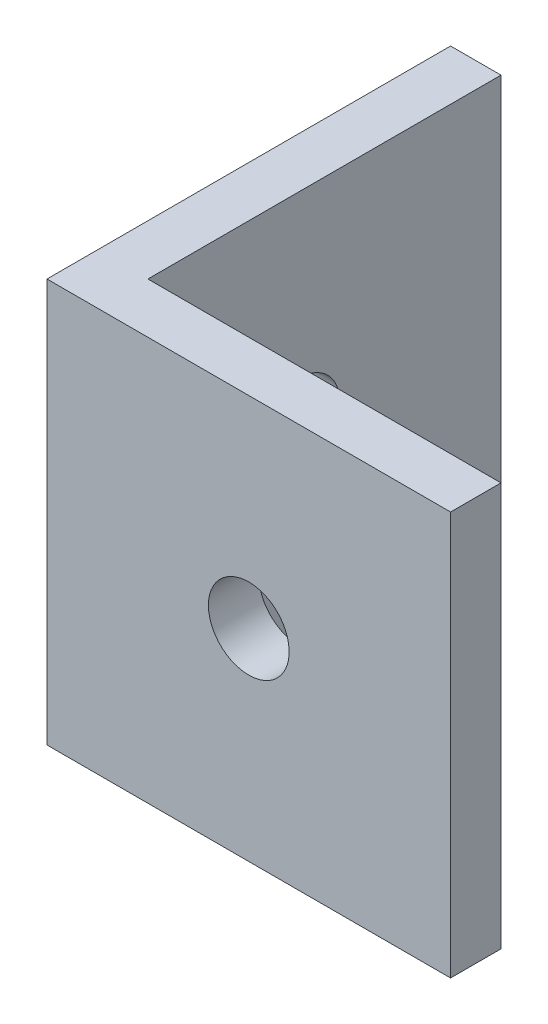
ISO-10303-21;
HEADER;
FILE_DESCRIPTION(('STEP AP214'),'2;1');
FILE_NAME('part.step','',(''),(''),'','','');
FILE_SCHEMA(('AUTOMOTIVE_DESIGN { 1 0 10303 214 1 1 1 1 }'));
ENDSEC;
DATA;
#1=APPLICATION_CONTEXT('core data for automotive mechanical design processes');
#2=APPLICATION_PROTOCOL_DEFINITION('international standard','automotive_design',2000,#1);
#3=PRODUCT_CONTEXT('',#1,'mechanical');
#4=PRODUCT('Part','Part','',(#3));
#5=PRODUCT_RELATED_PRODUCT_CATEGORY('part','',(#4));
#6=PRODUCT_DEFINITION_FORMATION('','',#4);
#7=PRODUCT_DEFINITION_CONTEXT('part definition',#1,'design');
#8=PRODUCT_DEFINITION('design','',#6,#7);
#9=PRODUCT_DEFINITION_SHAPE('','',#8);
#10=(LENGTH_UNIT() NAMED_UNIT(*) SI_UNIT(.MILLI.,.METRE.));
#11=(NAMED_UNIT(*) PLANE_ANGLE_UNIT() SI_UNIT($,.RADIAN.));
#12=(NAMED_UNIT(*) SI_UNIT($,.STERADIAN.) SOLID_ANGLE_UNIT());
#13=UNCERTAINTY_MEASURE_WITH_UNIT(LENGTH_MEASURE(1.E-05),#10,'distance_accuracy_value','');
#14=(GEOMETRIC_REPRESENTATION_CONTEXT(3) GLOBAL_UNCERTAINTY_ASSIGNED_CONTEXT((#13)) GLOBAL_UNIT_ASSIGNED_CONTEXT((#10,
#11,#12)) REPRESENTATION_CONTEXT('',''));
#15=CARTESIAN_POINT('',(0.,0.,0.));
#16=DIRECTION('',(0.,0.,1.));
#17=DIRECTION('',(1.,0.,0.));
#18=AXIS2_PLACEMENT_3D('',#15,#16,#17);
#19=CARTESIAN_POINT('',(0.,25.4,0.));
#20=DIRECTION('',(1.,0.,0.));
#21=DIRECTION('',(0.,0.,-1.));
#22=AXIS2_PLACEMENT_3D('',#19,#20,#21);
#23=PLANE('',#22);
#24=CARTESIAN_POINT('',(0.,12.7,-12.7));
#25=DIRECTION('',(1.,0.,0.));
#26=DIRECTION('',(0.,0.,-1.));
#27=AXIS2_PLACEMENT_3D('',#24,#25,#26);
#28=CIRCLE('',#27,2.54);
#29=CARTESIAN_POINT('',(0.,12.7,-15.24));
#30=VERTEX_POINT('',#29);
#31=EDGE_CURVE('E135',#30,#30,#28,.T.);
#32=ORIENTED_EDGE('',*,*,#31,.T.);
#33=EDGE_LOOP('',(#32));
#34=FACE_BOUND('',#33,.T.);
#35=DIRECTION('',(0.,0.,1.));
#36=VECTOR('',#35,1.);
#37=CARTESIAN_POINT('',(0.,0.,0.));
#38=LINE('',#37,#36);
#39=CARTESIAN_POINT('',(0.,0.,-25.4));
#40=VERTEX_POINT('',#39);
#41=CARTESIAN_POINT('',(0.,0.,0.));
#42=VERTEX_POINT('',#41);
#43=EDGE_CURVE('E130',#40,#42,#38,.T.);
#44=ORIENTED_EDGE('',*,*,#43,.T.);
#45=DIRECTION('',(0.,-1.,0.));
#46=VECTOR('',#45,1.);
#47=CARTESIAN_POINT('',(0.,25.4,0.));
#48=LINE('',#47,#46);
#49=CARTESIAN_POINT('',(0.,25.4,0.));
#50=VERTEX_POINT('',#49);
#51=EDGE_CURVE('E11',#50,#42,#48,.T.);
#52=ORIENTED_EDGE('',*,*,#51,.F.);
#53=DIRECTION('',(0.,0.,1.));
#54=VECTOR('',#53,1.);
#55=CARTESIAN_POINT('',(0.,25.4,0.));
#56=LINE('',#55,#54);
#57=CARTESIAN_POINT('',(0.,25.4,-25.4));
#58=VERTEX_POINT('',#57);
#59=EDGE_CURVE('E147',#58,#50,#56,.T.);
#60=ORIENTED_EDGE('',*,*,#59,.F.);
#61=DIRECTION('',(0.,-1.,0.));
#62=VECTOR('',#61,1.);
#63=CARTESIAN_POINT('',(0.,25.4,-25.4));
#64=LINE('',#63,#62);
#65=EDGE_CURVE('E126',#58,#40,#64,.T.);
#66=ORIENTED_EDGE('',*,*,#65,.T.);
#67=EDGE_LOOP('',(#44,#52,#60,#66));
#68=FACE_BOUND('',#67,.T.);
#69=ADVANCED_FACE('F41',(#34,#68),#23,.F.);
#70=CARTESIAN_POINT('',(3.175,25.4,0.));
#71=DIRECTION('',(0.,0.,-1.));
#72=DIRECTION('',(-1.,0.,0.));
#73=AXIS2_PLACEMENT_3D('',#70,#71,#72);
#74=PLANE('',#73);
#75=CARTESIAN_POINT('',(12.7,12.7,0.));
#76=DIRECTION('',(0.,0.,-1.));
#77=DIRECTION('',(-1.,0.,0.));
#78=AXIS2_PLACEMENT_3D('',#75,#76,#77);
#79=CIRCLE('',#78,2.54);
#80=CARTESIAN_POINT('',(10.16,12.7,0.));
#81=VERTEX_POINT('',#80);
#82=EDGE_CURVE('E190',#81,#81,#79,.T.);
#83=ORIENTED_EDGE('',*,*,#82,.T.);
#84=EDGE_LOOP('',(#83));
#85=FACE_BOUND('',#84,.T.);
#86=DIRECTION('',(1.,0.,0.));
#87=VECTOR('',#86,1.);
#88=CARTESIAN_POINT('',(3.175,0.,0.));
#89=LINE('',#88,#87);
#90=CARTESIAN_POINT('',(25.4,0.,0.));
#91=VERTEX_POINT('',#90);
#92=EDGE_CURVE('E134',#42,#91,#89,.T.);
#93=ORIENTED_EDGE('',*,*,#92,.T.);
#94=DIRECTION('',(0.,-1.,0.));
#95=VECTOR('',#94,1.);
#96=CARTESIAN_POINT('',(25.4,25.4,0.));
#97=LINE('',#96,#95);
#98=CARTESIAN_POINT('',(25.4,25.4,0.));
#99=VERTEX_POINT('',#98);
#100=EDGE_CURVE('E50',#99,#91,#97,.T.);
#101=ORIENTED_EDGE('',*,*,#100,.F.);
#102=DIRECTION('',(1.,0.,0.));
#103=VECTOR('',#102,1.);
#104=CARTESIAN_POINT('',(0.,25.4,0.));
#105=LINE('',#104,#103);
#106=EDGE_CURVE('E95',#50,#99,#105,.T.);
#107=ORIENTED_EDGE('',*,*,#106,.F.);
#108=ORIENTED_EDGE('',*,*,#51,.T.);
#109=EDGE_LOOP('',(#93,#101,#107,#108));
#110=FACE_BOUND('',#109,.T.);
#111=ADVANCED_FACE('F176',(#85,#110),#74,.F.);
#112=CARTESIAN_POINT('',(25.4,25.4,0.));
#113=DIRECTION('',(-1.,0.,0.));
#114=DIRECTION('',(0.,0.,1.));
#115=AXIS2_PLACEMENT_3D('',#112,#113,#114);
#116=PLANE('',#115);
#117=DIRECTION('',(0.,0.,-1.));
#118=VECTOR('',#117,1.);
#119=CARTESIAN_POINT('',(25.4,0.,0.));
#120=LINE('',#119,#118);
#121=CARTESIAN_POINT('',(25.4,0.,-3.175));
#122=VERTEX_POINT('',#121);
#123=EDGE_CURVE('E138',#91,#122,#120,.T.);
#124=ORIENTED_EDGE('',*,*,#123,.T.);
#125=DIRECTION('',(0.,-1.,0.));
#126=VECTOR('',#125,1.);
#127=CARTESIAN_POINT('',(25.4,25.4,-3.175));
#128=LINE('',#127,#126);
#129=CARTESIAN_POINT('',(25.4,25.4,-3.175));
#130=VERTEX_POINT('',#129);
#131=EDGE_CURVE('E119',#130,#122,#128,.T.);
#132=ORIENTED_EDGE('',*,*,#131,.F.);
#133=DIRECTION('',(0.,0.,-1.));
#134=VECTOR('',#133,1.);
#135=CARTESIAN_POINT('',(25.4,25.4,0.));
#136=LINE('',#135,#134);
#137=EDGE_CURVE('E108',#99,#130,#136,.T.);
#138=ORIENTED_EDGE('',*,*,#137,.F.);
#139=ORIENTED_EDGE('',*,*,#100,.T.);
#140=EDGE_LOOP('',(#124,#132,#138,#139));
#141=FACE_BOUND('',#140,.T.);
#142=ADVANCED_FACE('F157',(#141),#116,.F.);
#143=CARTESIAN_POINT('',(3.175,25.4,-3.175));
#144=DIRECTION('',(0.,0.,1.));
#145=DIRECTION('',(1.,0.,0.));
#146=AXIS2_PLACEMENT_3D('',#143,#144,#145);
#147=PLANE('',#146);
#148=CARTESIAN_POINT('',(12.7,12.7,-3.175));
#149=DIRECTION('',(0.,0.,-1.));
#150=DIRECTION('',(-1.,0.,0.));
#151=AXIS2_PLACEMENT_3D('',#148,#149,#150);
#152=CIRCLE('',#151,2.54);
#153=CARTESIAN_POINT('',(10.16,12.7,-3.175));
#154=VERTEX_POINT('',#153);
#155=EDGE_CURVE('E201',#154,#154,#152,.T.);
#156=ORIENTED_EDGE('',*,*,#155,.F.);
#157=EDGE_LOOP('',(#156));
#158=FACE_BOUND('',#157,.T.);
#159=DIRECTION('',(-1.,0.,0.));
#160=VECTOR('',#159,1.);
#161=CARTESIAN_POINT('',(3.175,0.,-3.175));
#162=LINE('',#161,#160);
#163=CARTESIAN_POINT('',(3.175,0.,-3.175));
#164=VERTEX_POINT('',#163);
#165=EDGE_CURVE('E117',#122,#164,#162,.T.);
#166=ORIENTED_EDGE('',*,*,#165,.T.);
#167=DIRECTION('',(0.,-1.,0.));
#168=VECTOR('',#167,1.);
#169=CARTESIAN_POINT('',(3.175,25.4,-3.175));
#170=LINE('',#169,#168);
#171=CARTESIAN_POINT('',(3.175,25.4,-3.175));
#172=VERTEX_POINT('',#171);
#173=EDGE_CURVE('E114',#172,#164,#170,.T.);
#174=ORIENTED_EDGE('',*,*,#173,.F.);
#175=DIRECTION('',(-1.,0.,0.));
#176=VECTOR('',#175,1.);
#177=CARTESIAN_POINT('',(3.175,25.4,-3.175));
#178=LINE('',#177,#176);
#179=EDGE_CURVE('E102',#130,#172,#178,.T.);
#180=ORIENTED_EDGE('',*,*,#179,.F.);
#181=ORIENTED_EDGE('',*,*,#131,.T.);
#182=EDGE_LOOP('',(#166,#174,#180,#181));
#183=FACE_BOUND('',#182,.T.);
#184=ADVANCED_FACE('F115',(#158,#183),#147,.F.);
#185=CARTESIAN_POINT('',(3.175,25.4,-3.175));
#186=DIRECTION('',(-1.,0.,0.));
#187=DIRECTION('',(0.,0.,1.));
#188=AXIS2_PLACEMENT_3D('',#185,#186,#187);
#189=PLANE('',#188);
#190=CARTESIAN_POINT('',(3.175,12.7,-12.7));
#191=DIRECTION('',(1.,0.,0.));
#192=DIRECTION('',(0.,0.,-1.));
#193=AXIS2_PLACEMENT_3D('',#190,#191,#192);
#194=CIRCLE('',#193,2.54);
#195=CARTESIAN_POINT('',(3.175,12.7,-15.24));
#196=VERTEX_POINT('',#195);
#197=EDGE_CURVE('E186',#196,#196,#194,.T.);
#198=ORIENTED_EDGE('',*,*,#197,.F.);
#199=EDGE_LOOP('',(#198));
#200=FACE_BOUND('',#199,.T.);
#201=DIRECTION('',(0.,0.,-1.));
#202=VECTOR('',#201,1.);
#203=CARTESIAN_POINT('',(3.175,0.,-3.175));
#204=LINE('',#203,#202);
#205=CARTESIAN_POINT('',(3.175,0.,-25.4));
#206=VERTEX_POINT('',#205);
#207=EDGE_CURVE('E81',#164,#206,#204,.T.);
#208=ORIENTED_EDGE('',*,*,#207,.T.);
#209=DIRECTION('',(0.,-1.,0.));
#210=VECTOR('',#209,1.);
#211=CARTESIAN_POINT('',(3.175,25.4,-25.4));
#212=LINE('',#211,#210);
#213=CARTESIAN_POINT('',(3.175,25.4,-25.4));
#214=VERTEX_POINT('',#213);
#215=EDGE_CURVE('E120',#214,#206,#212,.T.);
#216=ORIENTED_EDGE('',*,*,#215,.F.);
#217=DIRECTION('',(0.,0.,-1.));
#218=VECTOR('',#217,1.);
#219=CARTESIAN_POINT('',(3.175,25.4,-3.175));
#220=LINE('',#219,#218);
#221=EDGE_CURVE('E106',#172,#214,#220,.T.);
#222=ORIENTED_EDGE('',*,*,#221,.F.);
#223=ORIENTED_EDGE('',*,*,#173,.T.);
#224=EDGE_LOOP('',(#208,#216,#222,#223));
#225=FACE_BOUND('',#224,.T.);
#226=ADVANCED_FACE('F122',(#200,#225),#189,.F.);
#227=CARTESIAN_POINT('',(0.,25.4,-25.4));
#228=DIRECTION('',(0.,0.,1.));
#229=DIRECTION('',(1.,0.,0.));
#230=AXIS2_PLACEMENT_3D('',#227,#228,#229);
#231=PLANE('',#230);
#232=DIRECTION('',(-1.,0.,0.));
#233=VECTOR('',#232,1.);
#234=CARTESIAN_POINT('',(0.,0.,-25.4));
#235=LINE('',#234,#233);
#236=EDGE_CURVE('E87',#206,#40,#235,.T.);
#237=ORIENTED_EDGE('',*,*,#236,.T.);
#238=ORIENTED_EDGE('',*,*,#65,.F.);
#239=DIRECTION('',(-1.,0.,0.));
#240=VECTOR('',#239,1.);
#241=CARTESIAN_POINT('',(0.,25.4,-25.4));
#242=LINE('',#241,#240);
#243=EDGE_CURVE('E58',#214,#58,#242,.T.);
#244=ORIENTED_EDGE('',*,*,#243,.F.);
#245=ORIENTED_EDGE('',*,*,#215,.T.);
#246=EDGE_LOOP('',(#237,#238,#244,#245));
#247=FACE_BOUND('',#246,.T.);
#248=ADVANCED_FACE('F164',(#247),#231,.F.);
#249=CARTESIAN_POINT('',(0.,25.4,0.));
#250=DIRECTION('',(0.,-1.,0.));
#251=DIRECTION('',(0.,0.,-1.));
#252=AXIS2_PLACEMENT_3D('',#249,#250,#251);
#253=PLANE('',#252);
#254=ORIENTED_EDGE('',*,*,#59,.T.);
#255=ORIENTED_EDGE('',*,*,#106,.T.);
#256=ORIENTED_EDGE('',*,*,#137,.T.);
#257=ORIENTED_EDGE('',*,*,#179,.T.);
#258=ORIENTED_EDGE('',*,*,#221,.T.);
#259=ORIENTED_EDGE('',*,*,#243,.T.);
#260=EDGE_LOOP('',(#254,#255,#256,#257,#258,#259));
#261=FACE_BOUND('',#260,.T.);
#262=ADVANCED_FACE('F104',(#261),#253,.F.);
#263=CARTESIAN_POINT('',(0.,0.,0.));
#264=DIRECTION('',(0.,-1.,0.));
#265=DIRECTION('',(0.,0.,-1.));
#266=AXIS2_PLACEMENT_3D('',#263,#264,#265);
#267=PLANE('',#266);
#268=ORIENTED_EDGE('',*,*,#43,.F.);
#269=ORIENTED_EDGE('',*,*,#236,.F.);
#270=ORIENTED_EDGE('',*,*,#207,.F.);
#271=ORIENTED_EDGE('',*,*,#165,.F.);
#272=ORIENTED_EDGE('',*,*,#123,.F.);
#273=ORIENTED_EDGE('',*,*,#92,.F.);
#274=EDGE_LOOP('',(#268,#269,#270,#271,#272,#273));
#275=FACE_BOUND('',#274,.T.);
#276=ADVANCED_FACE('F160',(#275),#267,.T.);
#277=CARTESIAN_POINT('',(-22.225,12.7,-12.7));
#278=DIRECTION('',(1.,0.,0.));
#279=DIRECTION('',(0.,0.,-1.));
#280=AXIS2_PLACEMENT_3D('',#277,#278,#279);
#281=CYLINDRICAL_SURFACE('',#280,2.54);
#282=ORIENTED_EDGE('',*,*,#197,.T.);
#283=EDGE_LOOP('',(#282));
#284=FACE_BOUND('',#283,.T.);
#285=ORIENTED_EDGE('',*,*,#31,.F.);
#286=EDGE_LOOP('',(#285));
#287=FACE_BOUND('',#286,.T.);
#288=ADVANCED_FACE('F227',(#284,#287),#281,.F.);
#289=CARTESIAN_POINT('',(12.7,12.7,22.225));
#290=DIRECTION('',(0.,0.,-1.));
#291=DIRECTION('',(-1.,0.,0.));
#292=AXIS2_PLACEMENT_3D('',#289,#290,#291);
#293=CYLINDRICAL_SURFACE('',#292,2.54);
#294=ORIENTED_EDGE('',*,*,#155,.T.);
#295=EDGE_LOOP('',(#294));
#296=FACE_BOUND('',#295,.T.);
#297=ORIENTED_EDGE('',*,*,#82,.F.);
#298=EDGE_LOOP('',(#297));
#299=FACE_BOUND('',#298,.T.);
#300=ADVANCED_FACE('F206',(#296,#299),#293,.F.);
#301=CLOSED_SHELL('',(#69,#111,#142,#184,#226,#248,#262,#276,#288,#300));
#302=MANIFOLD_SOLID_BREP('B2',#301);
#303=ADVANCED_BREP_SHAPE_REPRESENTATION('',(#18,#302),#14);
#304=SHAPE_DEFINITION_REPRESENTATION(#9,#303);
ENDSEC;
END-ISO-10303-21;
